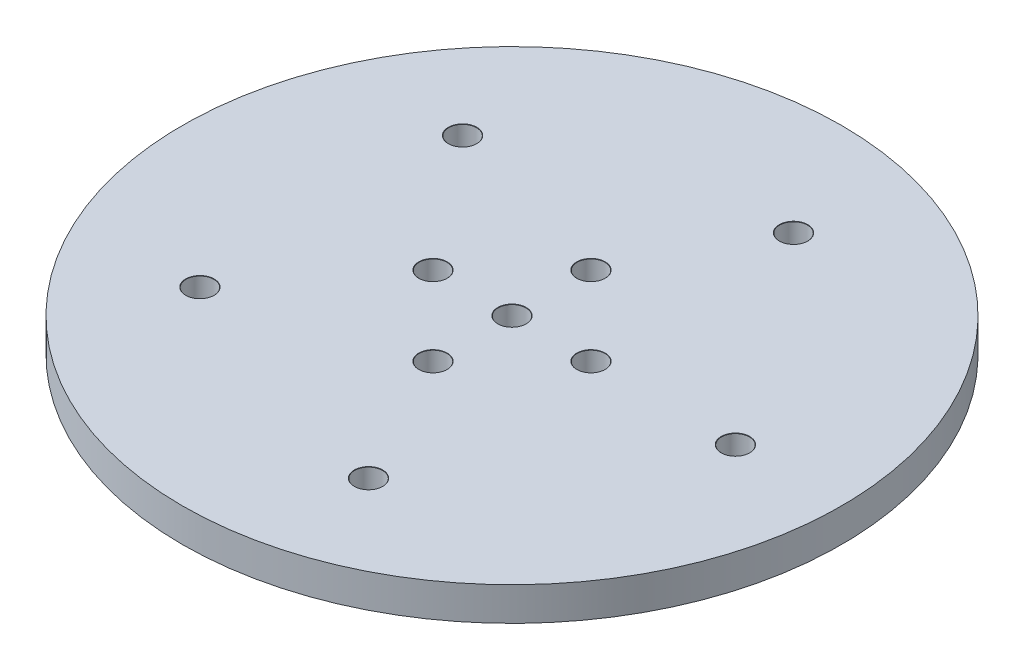
ISO-10303-21;
HEADER;
FILE_DESCRIPTION(('STEP AP214'),'2;1');
FILE_NAME('part.step','',(''),(''),'','','');
FILE_SCHEMA(('AUTOMOTIVE_DESIGN { 1 0 10303 214 1 1 1 1 }'));
ENDSEC;
DATA;
#1=APPLICATION_CONTEXT('core data for automotive mechanical design processes');
#2=APPLICATION_PROTOCOL_DEFINITION('international standard','automotive_design',2000,#1);
#3=PRODUCT_CONTEXT('',#1,'mechanical');
#4=PRODUCT('Part','Part','',(#3));
#5=PRODUCT_RELATED_PRODUCT_CATEGORY('part','',(#4));
#6=PRODUCT_DEFINITION_FORMATION('','',#4);
#7=PRODUCT_DEFINITION_CONTEXT('part definition',#1,'design');
#8=PRODUCT_DEFINITION('design','',#6,#7);
#9=PRODUCT_DEFINITION_SHAPE('','',#8);
#10=(LENGTH_UNIT() NAMED_UNIT(*) SI_UNIT(.MILLI.,.METRE.));
#11=(NAMED_UNIT(*) PLANE_ANGLE_UNIT() SI_UNIT($,.RADIAN.));
#12=(NAMED_UNIT(*) SI_UNIT($,.STERADIAN.) SOLID_ANGLE_UNIT());
#13=UNCERTAINTY_MEASURE_WITH_UNIT(LENGTH_MEASURE(1.E-05),#10,'distance_accuracy_value','');
#14=(GEOMETRIC_REPRESENTATION_CONTEXT(3) GLOBAL_UNCERTAINTY_ASSIGNED_CONTEXT((#13)) GLOBAL_UNIT_ASSIGNED_CONTEXT((#10,
#11,#12)) REPRESENTATION_CONTEXT('',''));
#15=CARTESIAN_POINT('',(0.,0.,0.));
#16=DIRECTION('',(0.,0.,1.));
#17=DIRECTION('',(1.,0.,0.));
#18=AXIS2_PLACEMENT_3D('',#15,#16,#17);
#19=CARTESIAN_POINT('',(0.,3.,0.));
#20=DIRECTION('',(0.,-1.,0.));
#21=DIRECTION('',(0.,0.,-1.));
#22=AXIS2_PLACEMENT_3D('',#19,#20,#21);
#23=CYLINDRICAL_SURFACE('',#22,29.5);
#24=CARTESIAN_POINT('',(0.,3.,0.));
#25=DIRECTION('',(0.,1.,0.));
#26=DIRECTION('',(0.,0.,1.));
#27=AXIS2_PLACEMENT_3D('',#24,#25,#26);
#28=CIRCLE('',#27,29.5);
#29=CARTESIAN_POINT('',(0.,3.,29.5));
#30=VERTEX_POINT('',#29);
#31=EDGE_CURVE('E10',#30,#30,#28,.T.);
#32=ORIENTED_EDGE('',*,*,#31,.F.);
#33=EDGE_LOOP('',(#32));
#34=FACE_BOUND('',#33,.T.);
#35=CARTESIAN_POINT('',(0.,0.,0.));
#36=DIRECTION('',(0.,1.,0.));
#37=DIRECTION('',(0.,0.,1.));
#38=AXIS2_PLACEMENT_3D('',#35,#36,#37);
#39=CIRCLE('',#38,29.5);
#40=CARTESIAN_POINT('',(0.,0.,29.5));
#41=VERTEX_POINT('',#40);
#42=EDGE_CURVE('E44',#41,#41,#39,.T.);
#43=ORIENTED_EDGE('',*,*,#42,.T.);
#44=EDGE_LOOP('',(#43));
#45=FACE_BOUND('',#44,.T.);
#46=ADVANCED_FACE('F41',(#34,#45),#23,.T.);
#47=CARTESIAN_POINT('',(0.,3.,0.));
#48=DIRECTION('',(0.,1.,0.));
#49=DIRECTION('',(0.,0.,1.));
#50=AXIS2_PLACEMENT_3D('',#47,#48,#49);
#51=PLANE('',#50);
#52=CARTESIAN_POINT('',(7.07106781186548,3.,0.));
#53=DIRECTION('',(0.,1.,0.));
#54=DIRECTION('',(0.,0.,1.));
#55=AXIS2_PLACEMENT_3D('',#52,#53,#54);
#56=CIRCLE('',#55,1.275);
#57=CARTESIAN_POINT('',(7.07106781186548,3.,1.275));
#58=VERTEX_POINT('',#57);
#59=EDGE_CURVE('E139',#58,#58,#56,.T.);
#60=ORIENTED_EDGE('',*,*,#59,.F.);
#61=EDGE_LOOP('',(#60));
#62=FACE_BOUND('',#61,.T.);
#63=CARTESIAN_POINT('',(0.,3.,7.07106781186548));
#64=DIRECTION('',(0.,1.,0.));
#65=DIRECTION('',(0.,0.,1.));
#66=AXIS2_PLACEMENT_3D('',#63,#64,#65);
#67=CIRCLE('',#66,1.275);
#68=CARTESIAN_POINT('',(0.,3.,8.34606781186548));
#69=VERTEX_POINT('',#68);
#70=EDGE_CURVE('E130',#69,#69,#67,.T.);
#71=ORIENTED_EDGE('',*,*,#70,.F.);
#72=EDGE_LOOP('',(#71));
#73=FACE_BOUND('',#72,.T.);
#74=CARTESIAN_POINT('',(-7.07106781186548,3.,0.));
#75=DIRECTION('',(0.,1.,0.));
#76=DIRECTION('',(0.,0.,1.));
#77=AXIS2_PLACEMENT_3D('',#74,#75,#76);
#78=CIRCLE('',#77,1.275);
#79=CARTESIAN_POINT('',(-7.07106781186548,3.,1.275));
#80=VERTEX_POINT('',#79);
#81=EDGE_CURVE('E121',#80,#80,#78,.T.);
#82=ORIENTED_EDGE('',*,*,#81,.F.);
#83=EDGE_LOOP('',(#82));
#84=FACE_BOUND('',#83,.T.);
#85=CARTESIAN_POINT('',(0.,3.,-7.07106781186548));
#86=DIRECTION('',(0.,1.,0.));
#87=DIRECTION('',(0.,0.,1.));
#88=AXIS2_PLACEMENT_3D('',#85,#86,#87);
#89=CIRCLE('',#88,1.275);
#90=CARTESIAN_POINT('',(0.,3.,-5.79606781186548));
#91=VERTEX_POINT('',#90);
#92=EDGE_CURVE('E112',#91,#91,#89,.T.);
#93=ORIENTED_EDGE('',*,*,#92,.F.);
#94=EDGE_LOOP('',(#93));
#95=FACE_BOUND('',#94,.T.);
#96=CARTESIAN_POINT('',(0.,3.,0.));
#97=DIRECTION('',(0.,1.,0.));
#98=DIRECTION('',(0.,0.,1.));
#99=AXIS2_PLACEMENT_3D('',#96,#97,#98);
#100=CIRCLE('',#99,1.275);
#101=CARTESIAN_POINT('',(0.,3.,1.275));
#102=VERTEX_POINT('',#101);
#103=EDGE_CURVE('E103',#102,#102,#100,.T.);
#104=ORIENTED_EDGE('',*,*,#103,.F.);
#105=EDGE_LOOP('',(#104));
#106=FACE_BOUND('',#105,.T.);
#107=CARTESIAN_POINT('',(20.,3.,0.));
#108=DIRECTION('',(0.,1.,0.));
#109=DIRECTION('',(0.,0.,1.));
#110=AXIS2_PLACEMENT_3D('',#107,#108,#109);
#111=CIRCLE('',#110,1.275);
#112=CARTESIAN_POINT('',(20.,3.,1.275));
#113=VERTEX_POINT('',#112);
#114=EDGE_CURVE('E94',#113,#113,#111,.T.);
#115=ORIENTED_EDGE('',*,*,#114,.F.);
#116=EDGE_LOOP('',(#115));
#117=FACE_BOUND('',#116,.T.);
#118=CARTESIAN_POINT('',(6.18033988749895,3.,19.0211303259031));
#119=DIRECTION('',(0.,1.,0.));
#120=DIRECTION('',(0.,0.,1.));
#121=AXIS2_PLACEMENT_3D('',#118,#119,#120);
#122=CIRCLE('',#121,1.275);
#123=CARTESIAN_POINT('',(6.18033988749895,3.,20.2961303259031));
#124=VERTEX_POINT('',#123);
#125=EDGE_CURVE('E85',#124,#124,#122,.T.);
#126=ORIENTED_EDGE('',*,*,#125,.F.);
#127=EDGE_LOOP('',(#126));
#128=FACE_BOUND('',#127,.T.);
#129=CARTESIAN_POINT('',(-16.1803398874989,3.,11.7557050458495));
#130=DIRECTION('',(0.,1.,0.));
#131=DIRECTION('',(0.,0.,1.));
#132=AXIS2_PLACEMENT_3D('',#129,#130,#131);
#133=CIRCLE('',#132,1.275);
#134=CARTESIAN_POINT('',(-16.1803398874989,3.,13.0307050458495));
#135=VERTEX_POINT('',#134);
#136=EDGE_CURVE('E76',#135,#135,#133,.T.);
#137=ORIENTED_EDGE('',*,*,#136,.F.);
#138=EDGE_LOOP('',(#137));
#139=FACE_BOUND('',#138,.T.);
#140=CARTESIAN_POINT('',(-16.180339887499,3.,-11.7557050458495));
#141=DIRECTION('',(0.,1.,0.));
#142=DIRECTION('',(0.,0.,1.));
#143=AXIS2_PLACEMENT_3D('',#140,#141,#142);
#144=CIRCLE('',#143,1.275);
#145=CARTESIAN_POINT('',(-16.180339887499,3.,-10.4807050458495));
#146=VERTEX_POINT('',#145);
#147=EDGE_CURVE('E67',#146,#146,#144,.T.);
#148=ORIENTED_EDGE('',*,*,#147,.F.);
#149=EDGE_LOOP('',(#148));
#150=FACE_BOUND('',#149,.T.);
#151=CARTESIAN_POINT('',(6.18033988749895,3.,-19.0211303259031));
#152=DIRECTION('',(0.,1.,0.));
#153=DIRECTION('',(0.,0.,1.));
#154=AXIS2_PLACEMENT_3D('',#151,#152,#153);
#155=CIRCLE('',#154,1.275);
#156=CARTESIAN_POINT('',(6.18033988749895,3.,-17.7461303259031));
#157=VERTEX_POINT('',#156);
#158=EDGE_CURVE('E58',#157,#157,#155,.T.);
#159=ORIENTED_EDGE('',*,*,#158,.F.);
#160=EDGE_LOOP('',(#159));
#161=FACE_BOUND('',#160,.T.);
#162=ORIENTED_EDGE('',*,*,#31,.T.);
#163=EDGE_LOOP('',(#162));
#164=FACE_BOUND('',#163,.T.);
#165=ADVANCED_FACE('F145',(#62,#73,#84,#95,#106,#117,#128,#139,#150,#161,#164),#51,.T.);
#166=CARTESIAN_POINT('',(0.,0.,0.));
#167=DIRECTION('',(0.,1.,0.));
#168=DIRECTION('',(0.,0.,1.));
#169=AXIS2_PLACEMENT_3D('',#166,#167,#168);
#170=PLANE('',#169);
#171=CARTESIAN_POINT('',(7.07106781186548,0.,0.));
#172=DIRECTION('',(0.,1.,0.));
#173=DIRECTION('',(0.,0.,1.));
#174=AXIS2_PLACEMENT_3D('',#171,#172,#173);
#175=CIRCLE('',#174,1.25);
#176=CARTESIAN_POINT('',(7.07106781186548,0.,1.25));
#177=VERTEX_POINT('',#176);
#178=EDGE_CURVE('E133',#177,#177,#175,.T.);
#179=ORIENTED_EDGE('',*,*,#178,.T.);
#180=EDGE_LOOP('',(#179));
#181=FACE_BOUND('',#180,.T.);
#182=CARTESIAN_POINT('',(0.,0.,7.07106781186548));
#183=DIRECTION('',(0.,1.,0.));
#184=DIRECTION('',(0.,0.,1.));
#185=AXIS2_PLACEMENT_3D('',#182,#183,#184);
#186=CIRCLE('',#185,1.25);
#187=CARTESIAN_POINT('',(0.,0.,8.32106781186548));
#188=VERTEX_POINT('',#187);
#189=EDGE_CURVE('E124',#188,#188,#186,.T.);
#190=ORIENTED_EDGE('',*,*,#189,.T.);
#191=EDGE_LOOP('',(#190));
#192=FACE_BOUND('',#191,.T.);
#193=CARTESIAN_POINT('',(-7.07106781186548,0.,0.));
#194=DIRECTION('',(0.,1.,0.));
#195=DIRECTION('',(0.,0.,1.));
#196=AXIS2_PLACEMENT_3D('',#193,#194,#195);
#197=CIRCLE('',#196,1.25);
#198=CARTESIAN_POINT('',(-7.07106781186548,0.,1.25));
#199=VERTEX_POINT('',#198);
#200=EDGE_CURVE('E115',#199,#199,#197,.T.);
#201=ORIENTED_EDGE('',*,*,#200,.T.);
#202=EDGE_LOOP('',(#201));
#203=FACE_BOUND('',#202,.T.);
#204=CARTESIAN_POINT('',(0.,0.,-7.07106781186548));
#205=DIRECTION('',(0.,1.,0.));
#206=DIRECTION('',(0.,0.,1.));
#207=AXIS2_PLACEMENT_3D('',#204,#205,#206);
#208=CIRCLE('',#207,1.25);
#209=CARTESIAN_POINT('',(0.,0.,-5.82106781186548));
#210=VERTEX_POINT('',#209);
#211=EDGE_CURVE('E106',#210,#210,#208,.T.);
#212=ORIENTED_EDGE('',*,*,#211,.T.);
#213=EDGE_LOOP('',(#212));
#214=FACE_BOUND('',#213,.T.);
#215=CARTESIAN_POINT('',(0.,0.,0.));
#216=DIRECTION('',(0.,1.,0.));
#217=DIRECTION('',(0.,0.,1.));
#218=AXIS2_PLACEMENT_3D('',#215,#216,#217);
#219=CIRCLE('',#218,1.25);
#220=CARTESIAN_POINT('',(0.,0.,1.25));
#221=VERTEX_POINT('',#220);
#222=EDGE_CURVE('E97',#221,#221,#219,.T.);
#223=ORIENTED_EDGE('',*,*,#222,.T.);
#224=EDGE_LOOP('',(#223));
#225=FACE_BOUND('',#224,.T.);
#226=CARTESIAN_POINT('',(20.,0.,0.));
#227=DIRECTION('',(0.,1.,0.));
#228=DIRECTION('',(0.,0.,1.));
#229=AXIS2_PLACEMENT_3D('',#226,#227,#228);
#230=CIRCLE('',#229,1.25);
#231=CARTESIAN_POINT('',(20.,0.,1.25));
#232=VERTEX_POINT('',#231);
#233=EDGE_CURVE('E88',#232,#232,#230,.T.);
#234=ORIENTED_EDGE('',*,*,#233,.T.);
#235=EDGE_LOOP('',(#234));
#236=FACE_BOUND('',#235,.T.);
#237=CARTESIAN_POINT('',(6.18033988749895,0.,19.0211303259031));
#238=DIRECTION('',(0.,1.,0.));
#239=DIRECTION('',(0.,0.,1.));
#240=AXIS2_PLACEMENT_3D('',#237,#238,#239);
#241=CIRCLE('',#240,1.25);
#242=CARTESIAN_POINT('',(6.18033988749895,0.,20.2711303259031));
#243=VERTEX_POINT('',#242);
#244=EDGE_CURVE('E79',#243,#243,#241,.T.);
#245=ORIENTED_EDGE('',*,*,#244,.T.);
#246=EDGE_LOOP('',(#245));
#247=FACE_BOUND('',#246,.T.);
#248=CARTESIAN_POINT('',(-16.1803398874989,0.,11.7557050458495));
#249=DIRECTION('',(0.,1.,0.));
#250=DIRECTION('',(0.,0.,1.));
#251=AXIS2_PLACEMENT_3D('',#248,#249,#250);
#252=CIRCLE('',#251,1.25);
#253=CARTESIAN_POINT('',(-16.1803398874989,0.,13.0057050458495));
#254=VERTEX_POINT('',#253);
#255=EDGE_CURVE('E70',#254,#254,#252,.T.);
#256=ORIENTED_EDGE('',*,*,#255,.T.);
#257=EDGE_LOOP('',(#256));
#258=FACE_BOUND('',#257,.T.);
#259=CARTESIAN_POINT('',(-16.180339887499,0.,-11.7557050458495));
#260=DIRECTION('',(0.,1.,0.));
#261=DIRECTION('',(0.,0.,1.));
#262=AXIS2_PLACEMENT_3D('',#259,#260,#261);
#263=CIRCLE('',#262,1.25);
#264=CARTESIAN_POINT('',(-16.180339887499,0.,-10.5057050458495));
#265=VERTEX_POINT('',#264);
#266=EDGE_CURVE('E61',#265,#265,#263,.T.);
#267=ORIENTED_EDGE('',*,*,#266,.T.);
#268=EDGE_LOOP('',(#267));
#269=FACE_BOUND('',#268,.T.);
#270=CARTESIAN_POINT('',(6.18033988749895,0.,-19.0211303259031));
#271=DIRECTION('',(0.,1.,0.));
#272=DIRECTION('',(0.,0.,1.));
#273=AXIS2_PLACEMENT_3D('',#270,#271,#272);
#274=CIRCLE('',#273,1.25);
#275=CARTESIAN_POINT('',(6.18033988749895,0.,-17.7711303259031));
#276=VERTEX_POINT('',#275);
#277=EDGE_CURVE('E51',#276,#276,#274,.T.);
#278=ORIENTED_EDGE('',*,*,#277,.T.);
#279=EDGE_LOOP('',(#278));
#280=FACE_BOUND('',#279,.T.);
#281=ORIENTED_EDGE('',*,*,#42,.F.);
#282=EDGE_LOOP('',(#281));
#283=FACE_BOUND('',#282,.T.);
#284=ADVANCED_FACE('F148',(#181,#192,#203,#214,#225,#236,#247,#258,#269,#280,#283),#170,.F.);
#285=CARTESIAN_POINT('',(6.18033988749895,3.,-19.0211303259031));
#286=DIRECTION('',(0.,1.,0.));
#287=DIRECTION('',(0.,0.,1.));
#288=AXIS2_PLACEMENT_3D('',#285,#286,#287);
#289=CYLINDRICAL_SURFACE('',#288,1.25);
#290=ORIENTED_EDGE('',*,*,#277,.F.);
#291=EDGE_LOOP('',(#290));
#292=FACE_BOUND('',#291,.T.);
#293=CARTESIAN_POINT('',(6.18033988749895,2.975,-19.0211303259031));
#294=DIRECTION('',(0.,1.,0.));
#295=DIRECTION('',(0.,0.,1.));
#296=AXIS2_PLACEMENT_3D('',#293,#294,#295);
#297=CIRCLE('',#296,1.25);
#298=CARTESIAN_POINT('',(6.18033988749895,2.975,-17.7711303259031));
#299=VERTEX_POINT('',#298);
#300=EDGE_CURVE('E55',#299,#299,#297,.T.);
#301=ORIENTED_EDGE('',*,*,#300,.T.);
#302=EDGE_LOOP('',(#301));
#303=FACE_BOUND('',#302,.T.);
#304=ADVANCED_FACE('F171',(#292,#303),#289,.F.);
#305=CARTESIAN_POINT('',(6.18033988749895,3.,-19.0211303259031));
#306=DIRECTION('',(0.,1.,0.));
#307=DIRECTION('',(0.,0.,1.));
#308=AXIS2_PLACEMENT_3D('',#305,#306,#307);
#309=CONICAL_SURFACE('',#308,1.275,0.785398163397474);
#310=ORIENTED_EDGE('',*,*,#300,.F.);
#311=EDGE_LOOP('',(#310));
#312=FACE_BOUND('',#311,.T.);
#313=ORIENTED_EDGE('',*,*,#158,.T.);
#314=EDGE_LOOP('',(#313));
#315=FACE_BOUND('',#314,.T.);
#316=ADVANCED_FACE('F168',(#312,#315),#309,.F.);
#317=CARTESIAN_POINT('',(-16.180339887499,3.,-11.7557050458495));
#318=DIRECTION('',(0.,1.,0.));
#319=DIRECTION('',(0.,0.,1.));
#320=AXIS2_PLACEMENT_3D('',#317,#318,#319);
#321=CYLINDRICAL_SURFACE('',#320,1.25);
#322=ORIENTED_EDGE('',*,*,#266,.F.);
#323=EDGE_LOOP('',(#322));
#324=FACE_BOUND('',#323,.T.);
#325=CARTESIAN_POINT('',(-16.180339887499,2.975,-11.7557050458495));
#326=DIRECTION('',(0.,1.,0.));
#327=DIRECTION('',(0.,0.,1.));
#328=AXIS2_PLACEMENT_3D('',#325,#326,#327);
#329=CIRCLE('',#328,1.25);
#330=CARTESIAN_POINT('',(-16.180339887499,2.975,-10.5057050458495));
#331=VERTEX_POINT('',#330);
#332=EDGE_CURVE('E64',#331,#331,#329,.T.);
#333=ORIENTED_EDGE('',*,*,#332,.T.);
#334=EDGE_LOOP('',(#333));
#335=FACE_BOUND('',#334,.T.);
#336=ADVANCED_FACE('F170',(#324,#335),#321,.F.);
#337=CARTESIAN_POINT('',(-16.180339887499,3.,-11.7557050458495));
#338=DIRECTION('',(0.,1.,0.));
#339=DIRECTION('',(0.,0.,1.));
#340=AXIS2_PLACEMENT_3D('',#337,#338,#339);
#341=CONICAL_SURFACE('',#340,1.275,0.785398163397474);
#342=ORIENTED_EDGE('',*,*,#332,.F.);
#343=EDGE_LOOP('',(#342));
#344=FACE_BOUND('',#343,.T.);
#345=ORIENTED_EDGE('',*,*,#147,.T.);
#346=EDGE_LOOP('',(#345));
#347=FACE_BOUND('',#346,.T.);
#348=ADVANCED_FACE('F178',(#344,#347),#341,.F.);
#349=CARTESIAN_POINT('',(-16.1803398874989,3.,11.7557050458495));
#350=DIRECTION('',(0.,1.,0.));
#351=DIRECTION('',(0.,0.,1.));
#352=AXIS2_PLACEMENT_3D('',#349,#350,#351);
#353=CYLINDRICAL_SURFACE('',#352,1.25);
#354=ORIENTED_EDGE('',*,*,#255,.F.);
#355=EDGE_LOOP('',(#354));
#356=FACE_BOUND('',#355,.T.);
#357=CARTESIAN_POINT('',(-16.1803398874989,2.975,11.7557050458495));
#358=DIRECTION('',(0.,1.,0.));
#359=DIRECTION('',(0.,0.,1.));
#360=AXIS2_PLACEMENT_3D('',#357,#358,#359);
#361=CIRCLE('',#360,1.25);
#362=CARTESIAN_POINT('',(-16.1803398874989,2.975,13.0057050458495));
#363=VERTEX_POINT('',#362);
#364=EDGE_CURVE('E73',#363,#363,#361,.T.);
#365=ORIENTED_EDGE('',*,*,#364,.T.);
#366=EDGE_LOOP('',(#365));
#367=FACE_BOUND('',#366,.T.);
#368=ADVANCED_FACE('F222',(#356,#367),#353,.F.);
#369=CARTESIAN_POINT('',(-16.1803398874989,3.,11.7557050458495));
#370=DIRECTION('',(0.,1.,0.));
#371=DIRECTION('',(0.,0.,1.));
#372=AXIS2_PLACEMENT_3D('',#369,#370,#371);
#373=CONICAL_SURFACE('',#372,1.275,0.785398163397474);
#374=ORIENTED_EDGE('',*,*,#364,.F.);
#375=EDGE_LOOP('',(#374));
#376=FACE_BOUND('',#375,.T.);
#377=ORIENTED_EDGE('',*,*,#136,.T.);
#378=EDGE_LOOP('',(#377));
#379=FACE_BOUND('',#378,.T.);
#380=ADVANCED_FACE('F227',(#376,#379),#373,.F.);
#381=CARTESIAN_POINT('',(6.18033988749895,3.,19.0211303259031));
#382=DIRECTION('',(0.,1.,0.));
#383=DIRECTION('',(0.,0.,1.));
#384=AXIS2_PLACEMENT_3D('',#381,#382,#383);
#385=CYLINDRICAL_SURFACE('',#384,1.25);
#386=ORIENTED_EDGE('',*,*,#244,.F.);
#387=EDGE_LOOP('',(#386));
#388=FACE_BOUND('',#387,.T.);
#389=CARTESIAN_POINT('',(6.18033988749895,2.975,19.0211303259031));
#390=DIRECTION('',(0.,1.,0.));
#391=DIRECTION('',(0.,0.,1.));
#392=AXIS2_PLACEMENT_3D('',#389,#390,#391);
#393=CIRCLE('',#392,1.25);
#394=CARTESIAN_POINT('',(6.18033988749895,2.975,20.2711303259031));
#395=VERTEX_POINT('',#394);
#396=EDGE_CURVE('E82',#395,#395,#393,.T.);
#397=ORIENTED_EDGE('',*,*,#396,.T.);
#398=EDGE_LOOP('',(#397));
#399=FACE_BOUND('',#398,.T.);
#400=ADVANCED_FACE('F233',(#388,#399),#385,.F.);
#401=CARTESIAN_POINT('',(6.18033988749895,3.,19.0211303259031));
#402=DIRECTION('',(0.,1.,0.));
#403=DIRECTION('',(0.,0.,1.));
#404=AXIS2_PLACEMENT_3D('',#401,#402,#403);
#405=CONICAL_SURFACE('',#404,1.275,0.785398163397474);
#406=ORIENTED_EDGE('',*,*,#396,.F.);
#407=EDGE_LOOP('',(#406));
#408=FACE_BOUND('',#407,.T.);
#409=ORIENTED_EDGE('',*,*,#125,.T.);
#410=EDGE_LOOP('',(#409));
#411=FACE_BOUND('',#410,.T.);
#412=ADVANCED_FACE('F237',(#408,#411),#405,.F.);
#413=CARTESIAN_POINT('',(20.,3.,0.));
#414=DIRECTION('',(0.,1.,0.));
#415=DIRECTION('',(0.,0.,1.));
#416=AXIS2_PLACEMENT_3D('',#413,#414,#415);
#417=CYLINDRICAL_SURFACE('',#416,1.25);
#418=ORIENTED_EDGE('',*,*,#233,.F.);
#419=EDGE_LOOP('',(#418));
#420=FACE_BOUND('',#419,.T.);
#421=CARTESIAN_POINT('',(20.,2.975,0.));
#422=DIRECTION('',(0.,1.,0.));
#423=DIRECTION('',(0.,0.,1.));
#424=AXIS2_PLACEMENT_3D('',#421,#422,#423);
#425=CIRCLE('',#424,1.25);
#426=CARTESIAN_POINT('',(20.,2.975,1.25));
#427=VERTEX_POINT('',#426);
#428=EDGE_CURVE('E91',#427,#427,#425,.T.);
#429=ORIENTED_EDGE('',*,*,#428,.T.);
#430=EDGE_LOOP('',(#429));
#431=FACE_BOUND('',#430,.T.);
#432=ADVANCED_FACE('F241',(#420,#431),#417,.F.);
#433=CARTESIAN_POINT('',(20.,3.,0.));
#434=DIRECTION('',(0.,1.,0.));
#435=DIRECTION('',(0.,0.,1.));
#436=AXIS2_PLACEMENT_3D('',#433,#434,#435);
#437=CONICAL_SURFACE('',#436,1.275,0.785398163397405);
#438=ORIENTED_EDGE('',*,*,#428,.F.);
#439=EDGE_LOOP('',(#438));
#440=FACE_BOUND('',#439,.T.);
#441=ORIENTED_EDGE('',*,*,#114,.T.);
#442=EDGE_LOOP('',(#441));
#443=FACE_BOUND('',#442,.T.);
#444=ADVANCED_FACE('F245',(#440,#443),#437,.F.);
#445=CARTESIAN_POINT('',(0.,3.,0.));
#446=DIRECTION('',(0.,1.,0.));
#447=DIRECTION('',(0.,0.,1.));
#448=AXIS2_PLACEMENT_3D('',#445,#446,#447);
#449=CYLINDRICAL_SURFACE('',#448,1.24999999999999);
#450=ORIENTED_EDGE('',*,*,#222,.F.);
#451=EDGE_LOOP('',(#450));
#452=FACE_BOUND('',#451,.T.);
#453=CARTESIAN_POINT('',(0.,2.97499999999998,0.));
#454=DIRECTION('',(0.,1.,0.));
#455=DIRECTION('',(0.,0.,1.));
#456=AXIS2_PLACEMENT_3D('',#453,#454,#455);
#457=CIRCLE('',#456,1.24999999999999);
#458=CARTESIAN_POINT('',(0.,2.97499999999998,1.24999999999999));
#459=VERTEX_POINT('',#458);
#460=EDGE_CURVE('E100',#459,#459,#457,.T.);
#461=ORIENTED_EDGE('',*,*,#460,.T.);
#462=EDGE_LOOP('',(#461));
#463=FACE_BOUND('',#462,.T.);
#464=ADVANCED_FACE('F249',(#452,#463),#449,.F.);
#465=CARTESIAN_POINT('',(0.,3.,0.));
#466=DIRECTION('',(0.,1.,0.));
#467=DIRECTION('',(0.,0.,1.));
#468=AXIS2_PLACEMENT_3D('',#465,#466,#467);
#469=CONICAL_SURFACE('',#468,1.275,0.785398163397171);
#470=ORIENTED_EDGE('',*,*,#460,.F.);
#471=EDGE_LOOP('',(#470));
#472=FACE_BOUND('',#471,.T.);
#473=ORIENTED_EDGE('',*,*,#103,.T.);
#474=EDGE_LOOP('',(#473));
#475=FACE_BOUND('',#474,.T.);
#476=ADVANCED_FACE('F253',(#472,#475),#469,.F.);
#477=CARTESIAN_POINT('',(0.,3.,-7.07106781186548));
#478=DIRECTION('',(0.,1.,0.));
#479=DIRECTION('',(0.,0.,1.));
#480=AXIS2_PLACEMENT_3D('',#477,#478,#479);
#481=CYLINDRICAL_SURFACE('',#480,1.24999999999999);
#482=ORIENTED_EDGE('',*,*,#211,.F.);
#483=EDGE_LOOP('',(#482));
#484=FACE_BOUND('',#483,.T.);
#485=CARTESIAN_POINT('',(0.,2.97499999999998,-7.07106781186548));
#486=DIRECTION('',(0.,1.,0.));
#487=DIRECTION('',(0.,0.,1.));
#488=AXIS2_PLACEMENT_3D('',#485,#486,#487);
#489=CIRCLE('',#488,1.24999999999999);
#490=CARTESIAN_POINT('',(0.,2.97499999999998,-5.82106781186549));
#491=VERTEX_POINT('',#490);
#492=EDGE_CURVE('E109',#491,#491,#489,.T.);
#493=ORIENTED_EDGE('',*,*,#492,.T.);
#494=EDGE_LOOP('',(#493));
#495=FACE_BOUND('',#494,.T.);
#496=ADVANCED_FACE('F257',(#484,#495),#481,.F.);
#497=CARTESIAN_POINT('',(0.,3.,-7.07106781186548));
#498=DIRECTION('',(0.,1.,0.));
#499=DIRECTION('',(0.,0.,1.));
#500=AXIS2_PLACEMENT_3D('',#497,#498,#499);
#501=CONICAL_SURFACE('',#500,1.275,0.785398163397171);
#502=ORIENTED_EDGE('',*,*,#492,.F.);
#503=EDGE_LOOP('',(#502));
#504=FACE_BOUND('',#503,.T.);
#505=ORIENTED_EDGE('',*,*,#92,.T.);
#506=EDGE_LOOP('',(#505));
#507=FACE_BOUND('',#506,.T.);
#508=ADVANCED_FACE('F261',(#504,#507),#501,.F.);
#509=CARTESIAN_POINT('',(-7.07106781186548,3.,0.));
#510=DIRECTION('',(0.,1.,0.));
#511=DIRECTION('',(0.,0.,1.));
#512=AXIS2_PLACEMENT_3D('',#509,#510,#511);
#513=CYLINDRICAL_SURFACE('',#512,1.24999999999999);
#514=ORIENTED_EDGE('',*,*,#200,.F.);
#515=EDGE_LOOP('',(#514));
#516=FACE_BOUND('',#515,.T.);
#517=CARTESIAN_POINT('',(-7.07106781186548,2.97499999999998,0.));
#518=DIRECTION('',(0.,1.,0.));
#519=DIRECTION('',(0.,0.,1.));
#520=AXIS2_PLACEMENT_3D('',#517,#518,#519);
#521=CIRCLE('',#520,1.24999999999999);
#522=CARTESIAN_POINT('',(-7.07106781186548,2.97499999999998,1.24999999999999));
#523=VERTEX_POINT('',#522);
#524=EDGE_CURVE('E118',#523,#523,#521,.T.);
#525=ORIENTED_EDGE('',*,*,#524,.T.);
#526=EDGE_LOOP('',(#525));
#527=FACE_BOUND('',#526,.T.);
#528=ADVANCED_FACE('F265',(#516,#527),#513,.F.);
#529=CARTESIAN_POINT('',(-7.07106781186548,3.,0.));
#530=DIRECTION('',(0.,1.,0.));
#531=DIRECTION('',(0.,0.,1.));
#532=AXIS2_PLACEMENT_3D('',#529,#530,#531);
#533=CONICAL_SURFACE('',#532,1.275,0.785398163397171);
#534=ORIENTED_EDGE('',*,*,#524,.F.);
#535=EDGE_LOOP('',(#534));
#536=FACE_BOUND('',#535,.T.);
#537=ORIENTED_EDGE('',*,*,#81,.T.);
#538=EDGE_LOOP('',(#537));
#539=FACE_BOUND('',#538,.T.);
#540=ADVANCED_FACE('F269',(#536,#539),#533,.F.);
#541=CARTESIAN_POINT('',(0.,3.,7.07106781186548));
#542=DIRECTION('',(0.,1.,0.));
#543=DIRECTION('',(0.,0.,1.));
#544=AXIS2_PLACEMENT_3D('',#541,#542,#543);
#545=CYLINDRICAL_SURFACE('',#544,1.24999999999999);
#546=ORIENTED_EDGE('',*,*,#189,.F.);
#547=EDGE_LOOP('',(#546));
#548=FACE_BOUND('',#547,.T.);
#549=CARTESIAN_POINT('',(0.,2.97499999999998,7.07106781186548));
#550=DIRECTION('',(0.,1.,0.));
#551=DIRECTION('',(0.,0.,1.));
#552=AXIS2_PLACEMENT_3D('',#549,#550,#551);
#553=CIRCLE('',#552,1.24999999999999);
#554=CARTESIAN_POINT('',(0.,2.97499999999998,8.32106781186546));
#555=VERTEX_POINT('',#554);
#556=EDGE_CURVE('E127',#555,#555,#553,.T.);
#557=ORIENTED_EDGE('',*,*,#556,.T.);
#558=EDGE_LOOP('',(#557));
#559=FACE_BOUND('',#558,.T.);
#560=ADVANCED_FACE('F273',(#548,#559),#545,.F.);
#561=CARTESIAN_POINT('',(0.,3.,7.07106781186548));
#562=DIRECTION('',(0.,1.,0.));
#563=DIRECTION('',(0.,0.,1.));
#564=AXIS2_PLACEMENT_3D('',#561,#562,#563);
#565=CONICAL_SURFACE('',#564,1.275,0.785398163397171);
#566=ORIENTED_EDGE('',*,*,#556,.F.);
#567=EDGE_LOOP('',(#566));
#568=FACE_BOUND('',#567,.T.);
#569=ORIENTED_EDGE('',*,*,#70,.T.);
#570=EDGE_LOOP('',(#569));
#571=FACE_BOUND('',#570,.T.);
#572=ADVANCED_FACE('F277',(#568,#571),#565,.F.);
#573=CARTESIAN_POINT('',(7.07106781186548,3.,0.));
#574=DIRECTION('',(0.,1.,0.));
#575=DIRECTION('',(0.,0.,1.));
#576=AXIS2_PLACEMENT_3D('',#573,#574,#575);
#577=CYLINDRICAL_SURFACE('',#576,1.24999999999999);
#578=ORIENTED_EDGE('',*,*,#178,.F.);
#579=EDGE_LOOP('',(#578));
#580=FACE_BOUND('',#579,.T.);
#581=CARTESIAN_POINT('',(7.07106781186548,2.97499999999998,0.));
#582=DIRECTION('',(0.,1.,0.));
#583=DIRECTION('',(0.,0.,1.));
#584=AXIS2_PLACEMENT_3D('',#581,#582,#583);
#585=CIRCLE('',#584,1.24999999999999);
#586=CARTESIAN_POINT('',(7.07106781186548,2.97499999999998,1.24999999999999));
#587=VERTEX_POINT('',#586);
#588=EDGE_CURVE('E136',#587,#587,#585,.T.);
#589=ORIENTED_EDGE('',*,*,#588,.T.);
#590=EDGE_LOOP('',(#589));
#591=FACE_BOUND('',#590,.T.);
#592=ADVANCED_FACE('F281',(#580,#591),#577,.F.);
#593=CARTESIAN_POINT('',(7.07106781186548,3.,0.));
#594=DIRECTION('',(0.,1.,0.));
#595=DIRECTION('',(0.,0.,1.));
#596=AXIS2_PLACEMENT_3D('',#593,#594,#595);
#597=CONICAL_SURFACE('',#596,1.275,0.785398163397171);
#598=ORIENTED_EDGE('',*,*,#588,.F.);
#599=EDGE_LOOP('',(#598));
#600=FACE_BOUND('',#599,.T.);
#601=ORIENTED_EDGE('',*,*,#59,.T.);
#602=EDGE_LOOP('',(#601));
#603=FACE_BOUND('',#602,.T.);
#604=ADVANCED_FACE('F143',(#600,#603),#597,.F.);
#605=CLOSED_SHELL('',(#46,#165,#284,#304,#316,#336,#348,#368,#380,#400,#412,#432,#444,#464,#476,
#496,#508,#528,#540,#560,#572,#592,#604));
#606=MANIFOLD_SOLID_BREP('B2',#605);
#607=ADVANCED_BREP_SHAPE_REPRESENTATION('',(#18,#606),#14);
#608=SHAPE_DEFINITION_REPRESENTATION(#9,#607);
ENDSEC;
END-ISO-10303-21;
